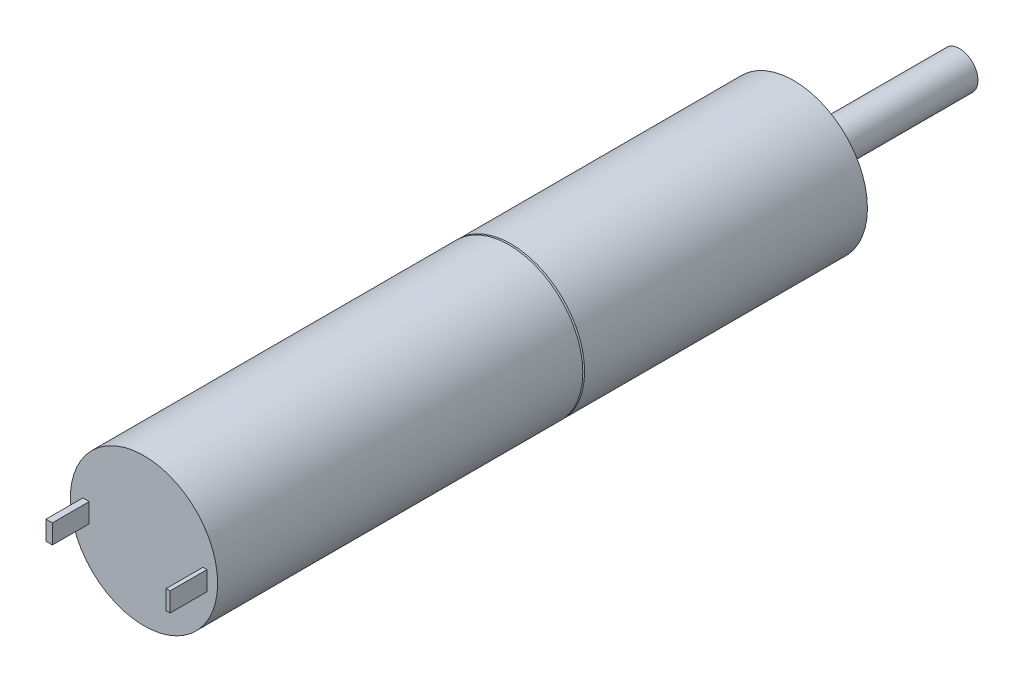
ISO-10303-21;
HEADER;
FILE_DESCRIPTION(('STEP AP214'),'2;1');
FILE_NAME('part.step','',(''),(''),'','','');
FILE_SCHEMA(('AUTOMOTIVE_DESIGN { 1 0 10303 214 1 1 1 1 }'));
ENDSEC;
DATA;
#1=APPLICATION_CONTEXT('core data for automotive mechanical design processes');
#2=APPLICATION_PROTOCOL_DEFINITION('international standard','automotive_design',2000,#1);
#3=PRODUCT_CONTEXT('',#1,'mechanical');
#4=PRODUCT('Part','Part','',(#3));
#5=PRODUCT_RELATED_PRODUCT_CATEGORY('part','',(#4));
#6=PRODUCT_DEFINITION_FORMATION('','',#4);
#7=PRODUCT_DEFINITION_CONTEXT('part definition',#1,'design');
#8=PRODUCT_DEFINITION('design','',#6,#7);
#9=PRODUCT_DEFINITION_SHAPE('','',#8);
#10=(LENGTH_UNIT() NAMED_UNIT(*) SI_UNIT(.MILLI.,.METRE.));
#11=(NAMED_UNIT(*) PLANE_ANGLE_UNIT() SI_UNIT($,.RADIAN.));
#12=(NAMED_UNIT(*) SI_UNIT($,.STERADIAN.) SOLID_ANGLE_UNIT());
#13=UNCERTAINTY_MEASURE_WITH_UNIT(LENGTH_MEASURE(1.E-05),#10,'distance_accuracy_value','');
#14=(GEOMETRIC_REPRESENTATION_CONTEXT(3) GLOBAL_UNCERTAINTY_ASSIGNED_CONTEXT((#13)) GLOBAL_UNIT_ASSIGNED_CONTEXT((#10,
#11,#12)) REPRESENTATION_CONTEXT('',''));
#15=CARTESIAN_POINT('',(0.,0.,0.));
#16=DIRECTION('',(0.,0.,1.));
#17=DIRECTION('',(1.,0.,0.));
#18=AXIS2_PLACEMENT_3D('',#15,#16,#17);
#19=CARTESIAN_POINT('',(0.,0.,-23.1));
#20=DIRECTION('',(0.,0.,1.));
#21=DIRECTION('',(1.,0.,0.));
#22=AXIS2_PLACEMENT_3D('',#19,#20,#21);
#23=CYLINDRICAL_SURFACE('',#22,6.);
#24=CARTESIAN_POINT('',(0.,0.,0.0727940468532392));
#25=DIRECTION('',(0.,0.,1.));
#26=DIRECTION('',(1.,0.,0.));
#27=AXIS2_PLACEMENT_3D('',#24,#25,#26);
#28=CIRCLE('',#27,6.);
#29=CARTESIAN_POINT('',(6.,0.,0.0727940468532392));
#30=VERTEX_POINT('',#29);
#31=EDGE_CURVE('E35',#30,#30,#28,.F.);
#32=ORIENTED_EDGE('',*,*,#31,.F.);
#33=EDGE_LOOP('',(#32));
#34=FACE_BOUND('',#33,.T.);
#35=CARTESIAN_POINT('',(0.,0.,29.8));
#36=DIRECTION('',(0.,0.,1.));
#37=DIRECTION('',(1.,0.,0.));
#38=AXIS2_PLACEMENT_3D('',#35,#36,#37);
#39=CIRCLE('',#38,6.);
#40=CARTESIAN_POINT('',(6.,0.,29.8));
#41=VERTEX_POINT('',#40);
#42=EDGE_CURVE('E155',#41,#41,#39,.T.);
#43=ORIENTED_EDGE('',*,*,#42,.F.);
#44=EDGE_LOOP('',(#43));
#45=FACE_BOUND('',#44,.T.);
#46=ADVANCED_FACE('F31',(#34,#45),#23,.T.);
#47=CARTESIAN_POINT('',(0.,0.,29.8));
#48=DIRECTION('',(0.,0.,1.));
#49=DIRECTION('',(1.,0.,0.));
#50=AXIS2_PLACEMENT_3D('',#47,#48,#49);
#51=PLANE('',#50);
#52=DIRECTION('',(1.,0.,0.));
#53=VECTOR('',#52,1.);
#54=CARTESIAN_POINT('',(4.80867690938958,-1.02837535009037,29.8));
#55=LINE('',#54,#53);
#56=CARTESIAN_POINT('',(4.80867690938958,-1.02837535009037,29.8));
#57=VERTEX_POINT('',#56);
#58=CARTESIAN_POINT('',(5.13075329447688,-1.02837535009037,29.8));
#59=VERTEX_POINT('',#58);
#60=EDGE_CURVE('E127',#57,#59,#55,.T.);
#61=ORIENTED_EDGE('',*,*,#60,.F.);
#62=DIRECTION('',(0.,-1.,0.));
#63=VECTOR('',#62,1.);
#64=CARTESIAN_POINT('',(4.80867690938958,0.535540550361091,29.8));
#65=LINE('',#64,#63);
#66=CARTESIAN_POINT('',(4.80867690938958,0.535540550361091,29.8));
#67=VERTEX_POINT('',#66);
#68=EDGE_CURVE('E124',#67,#57,#65,.T.);
#69=ORIENTED_EDGE('',*,*,#68,.F.);
#70=DIRECTION('',(-1.,0.,0.));
#71=VECTOR('',#70,1.);
#72=CARTESIAN_POINT('',(4.80867690938958,0.535540550361091,29.8));
#73=LINE('',#72,#71);
#74=CARTESIAN_POINT('',(5.13075329447688,0.535540550361091,29.8));
#75=VERTEX_POINT('',#74);
#76=EDGE_CURVE('E136',#75,#67,#73,.T.);
#77=ORIENTED_EDGE('',*,*,#76,.F.);
#78=DIRECTION('',(0.,1.,0.));
#79=VECTOR('',#78,1.);
#80=CARTESIAN_POINT('',(5.13075329447688,0.535540550361091,29.8));
#81=LINE('',#80,#79);
#82=EDGE_CURVE('E144',#59,#75,#81,.T.);
#83=ORIENTED_EDGE('',*,*,#82,.F.);
#84=EDGE_LOOP('',(#61,#69,#77,#83));
#85=FACE_BOUND('',#84,.T.);
#86=ORIENTED_EDGE('',*,*,#42,.T.);
#87=EDGE_LOOP('',(#86));
#88=FACE_BOUND('',#87,.T.);
#89=DIRECTION('',(1.,0.,0.));
#90=VECTOR('',#89,1.);
#91=CARTESIAN_POINT('',(-4.9747765863799,-1.02837535009037,29.8));
#92=LINE('',#91,#90);
#93=CARTESIAN_POINT('',(-4.9747765863799,-1.02837535009037,29.8));
#94=VERTEX_POINT('',#93);
#95=CARTESIAN_POINT('',(-4.45506110528449,-1.02837535009037,29.8));
#96=VERTEX_POINT('',#95);
#97=EDGE_CURVE('E189',#94,#96,#92,.T.);
#98=ORIENTED_EDGE('',*,*,#97,.F.);
#99=DIRECTION('',(0.,-1.,0.));
#100=VECTOR('',#99,1.);
#101=CARTESIAN_POINT('',(-4.9747765863799,0.535540550361091,29.8));
#102=LINE('',#101,#100);
#103=CARTESIAN_POINT('',(-4.9747765863799,0.535540550361091,29.8));
#104=VERTEX_POINT('',#103);
#105=EDGE_CURVE('E122',#104,#94,#102,.T.);
#106=ORIENTED_EDGE('',*,*,#105,.F.);
#107=DIRECTION('',(-1.,0.,0.));
#108=VECTOR('',#107,1.);
#109=CARTESIAN_POINT('',(-4.9747765863799,0.535540550361091,29.8));
#110=LINE('',#109,#108);
#111=CARTESIAN_POINT('',(-4.45506110528449,0.535540550361091,29.8));
#112=VERTEX_POINT('',#111);
#113=EDGE_CURVE('E118',#112,#104,#110,.T.);
#114=ORIENTED_EDGE('',*,*,#113,.F.);
#115=DIRECTION('',(0.,1.,0.));
#116=VECTOR('',#115,1.);
#117=CARTESIAN_POINT('',(-4.45506110528449,0.535540550361091,29.8));
#118=LINE('',#117,#116);
#119=EDGE_CURVE('E191',#96,#112,#118,.T.);
#120=ORIENTED_EDGE('',*,*,#119,.F.);
#121=EDGE_LOOP('',(#98,#106,#114,#120));
#122=FACE_BOUND('',#121,.T.);
#123=ADVANCED_FACE('F196',(#85,#88,#122),#51,.T.);
#124=CARTESIAN_POINT('',(4.80867690938958,0.535540550361091,32.8));
#125=DIRECTION('',(1.,0.,0.));
#126=DIRECTION('',(0.,0.,-1.));
#127=AXIS2_PLACEMENT_3D('',#124,#125,#126);
#128=PLANE('',#127);
#129=ORIENTED_EDGE('',*,*,#68,.T.);
#130=DIRECTION('',(0.,0.,-1.));
#131=VECTOR('',#130,1.);
#132=CARTESIAN_POINT('',(4.80867690938958,-1.02837535009037,32.8));
#133=LINE('',#132,#131);
#134=CARTESIAN_POINT('',(4.80867690938958,-1.02837535009037,32.8));
#135=VERTEX_POINT('',#134);
#136=EDGE_CURVE('E153',#135,#57,#133,.T.);
#137=ORIENTED_EDGE('',*,*,#136,.F.);
#138=DIRECTION('',(0.,-1.,0.));
#139=VECTOR('',#138,1.);
#140=CARTESIAN_POINT('',(4.80867690938958,0.535540550361091,32.8));
#141=LINE('',#140,#139);
#142=CARTESIAN_POINT('',(4.80867690938958,0.535540550361091,32.8));
#143=VERTEX_POINT('',#142);
#144=EDGE_CURVE('E132',#143,#135,#141,.T.);
#145=ORIENTED_EDGE('',*,*,#144,.F.);
#146=DIRECTION('',(0.,0.,-1.));
#147=VECTOR('',#146,1.);
#148=CARTESIAN_POINT('',(4.80867690938958,0.535540550361091,32.8));
#149=LINE('',#148,#147);
#150=EDGE_CURVE('E141',#143,#67,#149,.T.);
#151=ORIENTED_EDGE('',*,*,#150,.T.);
#152=EDGE_LOOP('',(#129,#137,#145,#151));
#153=FACE_BOUND('',#152,.T.);
#154=ADVANCED_FACE('F215',(#153),#128,.F.);
#155=CARTESIAN_POINT('',(4.80867690938958,-1.02837535009037,32.8));
#156=DIRECTION('',(0.,1.,0.));
#157=DIRECTION('',(0.,0.,1.));
#158=AXIS2_PLACEMENT_3D('',#155,#156,#157);
#159=PLANE('',#158);
#160=ORIENTED_EDGE('',*,*,#60,.T.);
#161=DIRECTION('',(0.,0.,-1.));
#162=VECTOR('',#161,1.);
#163=CARTESIAN_POINT('',(5.13075329447688,-1.02837535009037,32.8));
#164=LINE('',#163,#162);
#165=CARTESIAN_POINT('',(5.13075329447688,-1.02837535009037,32.8));
#166=VERTEX_POINT('',#165);
#167=EDGE_CURVE('E150',#166,#59,#164,.T.);
#168=ORIENTED_EDGE('',*,*,#167,.F.);
#169=DIRECTION('',(1.,0.,0.));
#170=VECTOR('',#169,1.);
#171=CARTESIAN_POINT('',(4.80867690938958,-1.02837535009037,32.8));
#172=LINE('',#171,#170);
#173=EDGE_CURVE('E135',#135,#166,#172,.T.);
#174=ORIENTED_EDGE('',*,*,#173,.F.);
#175=ORIENTED_EDGE('',*,*,#136,.T.);
#176=EDGE_LOOP('',(#160,#168,#174,#175));
#177=FACE_BOUND('',#176,.T.);
#178=ADVANCED_FACE('F379',(#177),#159,.F.);
#179=CARTESIAN_POINT('',(5.13075329447688,0.535540550361091,32.8));
#180=DIRECTION('',(-1.,0.,0.));
#181=DIRECTION('',(0.,0.,1.));
#182=AXIS2_PLACEMENT_3D('',#179,#180,#181);
#183=PLANE('',#182);
#184=ORIENTED_EDGE('',*,*,#82,.T.);
#185=DIRECTION('',(0.,0.,-1.));
#186=VECTOR('',#185,1.);
#187=CARTESIAN_POINT('',(5.13075329447688,0.535540550361091,32.8));
#188=LINE('',#187,#186);
#189=CARTESIAN_POINT('',(5.13075329447688,0.535540550361091,32.8));
#190=VERTEX_POINT('',#189);
#191=EDGE_CURVE('E56',#190,#75,#188,.T.);
#192=ORIENTED_EDGE('',*,*,#191,.F.);
#193=DIRECTION('',(0.,1.,0.));
#194=VECTOR('',#193,1.);
#195=CARTESIAN_POINT('',(5.13075329447688,0.535540550361091,32.8));
#196=LINE('',#195,#194);
#197=EDGE_CURVE('E138',#166,#190,#196,.T.);
#198=ORIENTED_EDGE('',*,*,#197,.F.);
#199=ORIENTED_EDGE('',*,*,#167,.T.);
#200=EDGE_LOOP('',(#184,#192,#198,#199));
#201=FACE_BOUND('',#200,.T.);
#202=ADVANCED_FACE('F370',(#201),#183,.F.);
#203=CARTESIAN_POINT('',(4.80867690938958,0.535540550361091,32.8));
#204=DIRECTION('',(0.,-1.,0.));
#205=DIRECTION('',(0.,0.,-1.));
#206=AXIS2_PLACEMENT_3D('',#203,#204,#205);
#207=PLANE('',#206);
#208=ORIENTED_EDGE('',*,*,#76,.T.);
#209=ORIENTED_EDGE('',*,*,#150,.F.);
#210=DIRECTION('',(-1.,0.,0.));
#211=VECTOR('',#210,1.);
#212=CARTESIAN_POINT('',(4.80867690938958,0.535540550361091,32.8));
#213=LINE('',#212,#211);
#214=EDGE_CURVE('E140',#190,#143,#213,.T.);
#215=ORIENTED_EDGE('',*,*,#214,.F.);
#216=ORIENTED_EDGE('',*,*,#191,.T.);
#217=EDGE_LOOP('',(#208,#209,#215,#216));
#218=FACE_BOUND('',#217,.T.);
#219=ADVANCED_FACE('F360',(#218),#207,.F.);
#220=CARTESIAN_POINT('',(4.80867690938958,-1.02837535009037,32.8));
#221=DIRECTION('',(0.,0.,1.));
#222=DIRECTION('',(1.,0.,0.));
#223=AXIS2_PLACEMENT_3D('',#220,#221,#222);
#224=PLANE('',#223);
#225=ORIENTED_EDGE('',*,*,#144,.T.);
#226=ORIENTED_EDGE('',*,*,#173,.T.);
#227=ORIENTED_EDGE('',*,*,#197,.T.);
#228=ORIENTED_EDGE('',*,*,#214,.T.);
#229=EDGE_LOOP('',(#225,#226,#227,#228));
#230=FACE_BOUND('',#229,.T.);
#231=ADVANCED_FACE('F351',(#230),#224,.T.);
#232=CARTESIAN_POINT('',(-4.9747765863799,0.535540550361091,32.8));
#233=DIRECTION('',(1.,0.,0.));
#234=DIRECTION('',(0.,0.,-1.));
#235=AXIS2_PLACEMENT_3D('',#232,#233,#234);
#236=PLANE('',#235);
#237=ORIENTED_EDGE('',*,*,#105,.T.);
#238=DIRECTION('',(0.,0.,-1.));
#239=VECTOR('',#238,1.);
#240=CARTESIAN_POINT('',(-4.9747765863799,-1.02837535009037,32.8));
#241=LINE('',#240,#239);
#242=CARTESIAN_POINT('',(-4.9747765863799,-1.02837535009037,32.8));
#243=VERTEX_POINT('',#242);
#244=EDGE_CURVE('E103',#243,#94,#241,.T.);
#245=ORIENTED_EDGE('',*,*,#244,.F.);
#246=DIRECTION('',(0.,-1.,0.));
#247=VECTOR('',#246,1.);
#248=CARTESIAN_POINT('',(-4.9747765863799,0.535540550361091,32.8));
#249=LINE('',#248,#247);
#250=CARTESIAN_POINT('',(-4.9747765863799,0.535540550361091,32.8));
#251=VERTEX_POINT('',#250);
#252=EDGE_CURVE('E110',#251,#243,#249,.T.);
#253=ORIENTED_EDGE('',*,*,#252,.F.);
#254=DIRECTION('',(0.,0.,-1.));
#255=VECTOR('',#254,1.);
#256=CARTESIAN_POINT('',(-4.9747765863799,0.535540550361091,32.8));
#257=LINE('',#256,#255);
#258=EDGE_CURVE('E187',#251,#104,#257,.T.);
#259=ORIENTED_EDGE('',*,*,#258,.T.);
#260=EDGE_LOOP('',(#237,#245,#253,#259));
#261=FACE_BOUND('',#260,.T.);
#262=ADVANCED_FACE('F120',(#261),#236,.F.);
#263=CARTESIAN_POINT('',(-4.9747765863799,-1.02837535009037,32.8));
#264=DIRECTION('',(0.,1.,0.));
#265=DIRECTION('',(0.,0.,1.));
#266=AXIS2_PLACEMENT_3D('',#263,#264,#265);
#267=PLANE('',#266);
#268=ORIENTED_EDGE('',*,*,#97,.T.);
#269=DIRECTION('',(0.,0.,-1.));
#270=VECTOR('',#269,1.);
#271=CARTESIAN_POINT('',(-4.45506110528449,-1.02837535009037,32.8));
#272=LINE('',#271,#270);
#273=CARTESIAN_POINT('',(-4.45506110528449,-1.02837535009037,32.8));
#274=VERTEX_POINT('',#273);
#275=EDGE_CURVE('E106',#274,#96,#272,.T.);
#276=ORIENTED_EDGE('',*,*,#275,.F.);
#277=DIRECTION('',(1.,0.,0.));
#278=VECTOR('',#277,1.);
#279=CARTESIAN_POINT('',(-4.9747765863799,-1.02837535009037,32.8));
#280=LINE('',#279,#278);
#281=EDGE_CURVE('E99',#243,#274,#280,.T.);
#282=ORIENTED_EDGE('',*,*,#281,.F.);
#283=ORIENTED_EDGE('',*,*,#244,.T.);
#284=EDGE_LOOP('',(#268,#276,#282,#283));
#285=FACE_BOUND('',#284,.T.);
#286=ADVANCED_FACE('F101',(#285),#267,.F.);
#287=CARTESIAN_POINT('',(-4.45506110528449,0.535540550361091,32.8));
#288=DIRECTION('',(-1.,0.,0.));
#289=DIRECTION('',(0.,0.,1.));
#290=AXIS2_PLACEMENT_3D('',#287,#288,#289);
#291=PLANE('',#290);
#292=ORIENTED_EDGE('',*,*,#119,.T.);
#293=DIRECTION('',(0.,0.,-1.));
#294=VECTOR('',#293,1.);
#295=CARTESIAN_POINT('',(-4.45506110528449,0.535540550361091,32.8));
#296=LINE('',#295,#294);
#297=CARTESIAN_POINT('',(-4.45506110528449,0.535540550361091,32.8));
#298=VERTEX_POINT('',#297);
#299=EDGE_CURVE('E48',#298,#112,#296,.T.);
#300=ORIENTED_EDGE('',*,*,#299,.F.);
#301=DIRECTION('',(0.,1.,0.));
#302=VECTOR('',#301,1.);
#303=CARTESIAN_POINT('',(-4.45506110528449,0.535540550361091,32.8));
#304=LINE('',#303,#302);
#305=EDGE_CURVE('E109',#274,#298,#304,.T.);
#306=ORIENTED_EDGE('',*,*,#305,.F.);
#307=ORIENTED_EDGE('',*,*,#275,.T.);
#308=EDGE_LOOP('',(#292,#300,#306,#307));
#309=FACE_BOUND('',#308,.T.);
#310=ADVANCED_FACE('F199',(#309),#291,.F.);
#311=CARTESIAN_POINT('',(-4.9747765863799,0.535540550361091,32.8));
#312=DIRECTION('',(0.,-1.,0.));
#313=DIRECTION('',(0.,0.,-1.));
#314=AXIS2_PLACEMENT_3D('',#311,#312,#313);
#315=PLANE('',#314);
#316=ORIENTED_EDGE('',*,*,#113,.T.);
#317=ORIENTED_EDGE('',*,*,#258,.F.);
#318=DIRECTION('',(-1.,0.,0.));
#319=VECTOR('',#318,1.);
#320=CARTESIAN_POINT('',(-4.9747765863799,0.535540550361091,32.8));
#321=LINE('',#320,#319);
#322=EDGE_CURVE('E114',#298,#251,#321,.T.);
#323=ORIENTED_EDGE('',*,*,#322,.F.);
#324=ORIENTED_EDGE('',*,*,#299,.T.);
#325=EDGE_LOOP('',(#316,#317,#323,#324));
#326=FACE_BOUND('',#325,.T.);
#327=ADVANCED_FACE('F200',(#326),#315,.F.);
#328=CARTESIAN_POINT('',(-4.9747765863799,-1.02837535009037,32.8));
#329=DIRECTION('',(0.,0.,1.));
#330=DIRECTION('',(1.,0.,0.));
#331=AXIS2_PLACEMENT_3D('',#328,#329,#330);
#332=PLANE('',#331);
#333=ORIENTED_EDGE('',*,*,#252,.T.);
#334=ORIENTED_EDGE('',*,*,#281,.T.);
#335=ORIENTED_EDGE('',*,*,#305,.T.);
#336=ORIENTED_EDGE('',*,*,#322,.T.);
#337=EDGE_LOOP('',(#333,#334,#335,#336));
#338=FACE_BOUND('',#337,.T.);
#339=ADVANCED_FACE('F113',(#338),#332,.T.);
#340=CARTESIAN_POINT('',(0.,0.,0.714830227866669));
#341=DIRECTION('',(0.,0.,1.));
#342=DIRECTION('',(1.,0.,0.));
#343=AXIS2_PLACEMENT_3D('',#340,#341,#342);
#344=CONICAL_SURFACE('',#343,7.76397990980731,1.22173047639604);
#345=ORIENTED_EDGE('',*,*,#31,.T.);
#346=EDGE_LOOP('',(#345));
#347=FACE_BOUND('',#346,.T.);
#348=CARTESIAN_POINT('',(0.,0.,0.));
#349=DIRECTION('',(0.,0.,-1.));
#350=DIRECTION('',(-1.,0.,0.));
#351=AXIS2_PLACEMENT_3D('',#348,#349,#350);
#352=CIRCLE('',#351,5.8);
#353=CARTESIAN_POINT('',(-5.8,0.,0.));
#354=VERTEX_POINT('',#353);
#355=EDGE_CURVE('E161',#354,#354,#352,.T.);
#356=ORIENTED_EDGE('',*,*,#355,.F.);
#357=EDGE_LOOP('',(#356));
#358=FACE_BOUND('',#357,.T.);
#359=ADVANCED_FACE('F207',(#347,#358),#344,.T.);
#360=CARTESIAN_POINT('',(0.,0.,0.));
#361=DIRECTION('',(0.,0.,-1.));
#362=DIRECTION('',(-1.,0.,0.));
#363=AXIS2_PLACEMENT_3D('',#360,#361,#362);
#364=CONICAL_SURFACE('',#363,5.8,1.22173047639603);
#365=CARTESIAN_POINT('',(0.,0.,-0.0727940468532405));
#366=DIRECTION('',(0.,0.,-1.));
#367=DIRECTION('',(-1.,0.,0.));
#368=AXIS2_PLACEMENT_3D('',#365,#366,#367);
#369=CIRCLE('',#368,6.);
#370=CARTESIAN_POINT('',(-6.,0.,-0.0727940468532405));
#371=VERTEX_POINT('',#370);
#372=EDGE_CURVE('E159',#371,#371,#369,.F.);
#373=ORIENTED_EDGE('',*,*,#372,.T.);
#374=EDGE_LOOP('',(#373));
#375=FACE_BOUND('',#374,.T.);
#376=ORIENTED_EDGE('',*,*,#355,.T.);
#377=EDGE_LOOP('',(#376));
#378=FACE_BOUND('',#377,.T.);
#379=ADVANCED_FACE('F253',(#375,#378),#364,.T.);
#380=CARTESIAN_POINT('',(0.,0.,-36.6));
#381=DIRECTION('',(0.,0.,-1.));
#382=DIRECTION('',(-1.,0.,0.));
#383=AXIS2_PLACEMENT_3D('',#380,#381,#382);
#384=PLANE('',#383);
#385=CARTESIAN_POINT('',(0.,0.,-36.6));
#386=DIRECTION('',(0.,0.,-1.));
#387=DIRECTION('',(-1.,0.,0.));
#388=AXIS2_PLACEMENT_3D('',#385,#386,#387);
#389=CIRCLE('',#388,1.5);
#390=CARTESIAN_POINT('',(-1.5,0.,-36.6));
#391=VERTEX_POINT('',#390);
#392=EDGE_CURVE('E180',#391,#391,#389,.T.);
#393=ORIENTED_EDGE('',*,*,#392,.T.);
#394=EDGE_LOOP('',(#393));
#395=FACE_BOUND('',#394,.T.);
#396=ADVANCED_FACE('F251',(#395),#384,.T.);
#397=CARTESIAN_POINT('',(-4.75,0.,-9.6));
#398=DIRECTION('',(0.,0.,-1.));
#399=DIRECTION('',(-1.,0.,0.));
#400=AXIS2_PLACEMENT_3D('',#397,#398,#399);
#401=PLANE('',#400);
#402=CARTESIAN_POINT('',(-4.75,0.,-9.6));
#403=DIRECTION('',(0.,0.,-1.));
#404=DIRECTION('',(-1.,0.,0.));
#405=AXIS2_PLACEMENT_3D('',#402,#403,#404);
#406=CIRCLE('',#405,1.);
#407=CARTESIAN_POINT('',(-5.75,0.,-9.6));
#408=VERTEX_POINT('',#407);
#409=EDGE_CURVE('E177',#408,#408,#406,.T.);
#410=ORIENTED_EDGE('',*,*,#409,.T.);
#411=EDGE_LOOP('',(#410));
#412=FACE_BOUND('',#411,.T.);
#413=ADVANCED_FACE('F246',(#412),#401,.T.);
#414=CARTESIAN_POINT('',(4.75,0.,-9.6));
#415=DIRECTION('',(0.,0.,-1.));
#416=DIRECTION('',(-1.,0.,0.));
#417=AXIS2_PLACEMENT_3D('',#414,#415,#416);
#418=PLANE('',#417);
#419=CARTESIAN_POINT('',(4.75,0.,-9.6));
#420=DIRECTION('',(0.,0.,-1.));
#421=DIRECTION('',(-1.,0.,0.));
#422=AXIS2_PLACEMENT_3D('',#419,#420,#421);
#423=CIRCLE('',#422,1.);
#424=CARTESIAN_POINT('',(3.75,0.,-9.6));
#425=VERTEX_POINT('',#424);
#426=EDGE_CURVE('E171',#425,#425,#423,.T.);
#427=ORIENTED_EDGE('',*,*,#426,.T.);
#428=EDGE_LOOP('',(#427));
#429=FACE_BOUND('',#428,.T.);
#430=ADVANCED_FACE('F237',(#429),#418,.T.);
#431=CARTESIAN_POINT('',(0.,0.,-36.6));
#432=DIRECTION('',(0.,0.,1.));
#433=DIRECTION('',(1.,0.,0.));
#434=AXIS2_PLACEMENT_3D('',#431,#432,#433);
#435=CYLINDRICAL_SURFACE('',#434,1.5);
#436=ORIENTED_EDGE('',*,*,#392,.F.);
#437=EDGE_LOOP('',(#436));
#438=FACE_BOUND('',#437,.T.);
#439=CARTESIAN_POINT('',(0.,0.,-23.1));
#440=DIRECTION('',(0.,0.,1.));
#441=DIRECTION('',(1.,0.,0.));
#442=AXIS2_PLACEMENT_3D('',#439,#440,#441);
#443=CIRCLE('',#442,1.5);
#444=CARTESIAN_POINT('',(1.5,0.,-23.1));
#445=VERTEX_POINT('',#444);
#446=EDGE_CURVE('E11',#445,#445,#443,.F.);
#447=ORIENTED_EDGE('',*,*,#446,.T.);
#448=EDGE_LOOP('',(#447));
#449=FACE_BOUND('',#448,.T.);
#450=ADVANCED_FACE('F234',(#438,#449),#435,.T.);
#451=CARTESIAN_POINT('',(-4.75,0.,-9.6));
#452=DIRECTION('',(0.,0.,-1.));
#453=DIRECTION('',(-1.,0.,0.));
#454=AXIS2_PLACEMENT_3D('',#451,#452,#453);
#455=CYLINDRICAL_SURFACE('',#454,1.);
#456=ORIENTED_EDGE('',*,*,#409,.F.);
#457=EDGE_LOOP('',(#456));
#458=FACE_BOUND('',#457,.T.);
#459=CARTESIAN_POINT('',(-4.75,0.,-23.1));
#460=DIRECTION('',(0.,0.,-1.));
#461=DIRECTION('',(-1.,0.,0.));
#462=AXIS2_PLACEMENT_3D('',#459,#460,#461);
#463=CIRCLE('',#462,1.);
#464=CARTESIAN_POINT('',(-5.75,0.,-23.1));
#465=VERTEX_POINT('',#464);
#466=EDGE_CURVE('E174',#465,#465,#463,.T.);
#467=ORIENTED_EDGE('',*,*,#466,.T.);
#468=EDGE_LOOP('',(#467));
#469=FACE_BOUND('',#468,.T.);
#470=ADVANCED_FACE('F236',(#458,#469),#455,.F.);
#471=CARTESIAN_POINT('',(4.75,0.,-9.6));
#472=DIRECTION('',(0.,0.,-1.));
#473=DIRECTION('',(-1.,0.,0.));
#474=AXIS2_PLACEMENT_3D('',#471,#472,#473);
#475=CYLINDRICAL_SURFACE('',#474,1.);
#476=ORIENTED_EDGE('',*,*,#426,.F.);
#477=EDGE_LOOP('',(#476));
#478=FACE_BOUND('',#477,.T.);
#479=CARTESIAN_POINT('',(4.75,0.,-23.1));
#480=DIRECTION('',(0.,0.,-1.));
#481=DIRECTION('',(-1.,0.,0.));
#482=AXIS2_PLACEMENT_3D('',#479,#480,#481);
#483=CIRCLE('',#482,1.);
#484=CARTESIAN_POINT('',(3.75,0.,-23.1));
#485=VERTEX_POINT('',#484);
#486=EDGE_CURVE('E165',#485,#485,#483,.T.);
#487=ORIENTED_EDGE('',*,*,#486,.T.);
#488=EDGE_LOOP('',(#487));
#489=FACE_BOUND('',#488,.T.);
#490=ADVANCED_FACE('F226',(#478,#489),#475,.F.);
#491=CARTESIAN_POINT('',(0.,0.,-23.1));
#492=DIRECTION('',(0.,0.,1.));
#493=DIRECTION('',(1.,0.,0.));
#494=AXIS2_PLACEMENT_3D('',#491,#492,#493);
#495=PLANE('',#494);
#496=ORIENTED_EDGE('',*,*,#486,.F.);
#497=EDGE_LOOP('',(#496));
#498=FACE_BOUND('',#497,.T.);
#499=ORIENTED_EDGE('',*,*,#466,.F.);
#500=EDGE_LOOP('',(#499));
#501=FACE_BOUND('',#500,.T.);
#502=CARTESIAN_POINT('',(0.,0.,-23.1));
#503=DIRECTION('',(0.,0.,1.));
#504=DIRECTION('',(1.,0.,0.));
#505=AXIS2_PLACEMENT_3D('',#502,#503,#504);
#506=CIRCLE('',#505,6.);
#507=CARTESIAN_POINT('',(6.,0.,-23.1));
#508=VERTEX_POINT('',#507);
#509=EDGE_CURVE('E40',#508,#508,#506,.T.);
#510=ORIENTED_EDGE('',*,*,#509,.F.);
#511=EDGE_LOOP('',(#510));
#512=FACE_BOUND('',#511,.T.);
#513=ORIENTED_EDGE('',*,*,#446,.F.);
#514=EDGE_LOOP('',(#513));
#515=FACE_BOUND('',#514,.T.);
#516=ADVANCED_FACE('F221',(#498,#501,#512,#515),#495,.F.);
#517=ORIENTED_EDGE('',*,*,#372,.F.);
#518=EDGE_LOOP('',(#517));
#519=FACE_BOUND('',#518,.T.);
#520=ORIENTED_EDGE('',*,*,#509,.T.);
#521=EDGE_LOOP('',(#520));
#522=FACE_BOUND('',#521,.T.);
#523=ADVANCED_FACE('F33',(#519,#522),#23,.T.);
#524=CLOSED_SHELL('',(#46,#123,#154,#178,#202,#219,#231,#262,#286,#310,#327,#339,#359,#379,#396,
#413,#430,#450,#470,#490,#516,#523));
#525=MANIFOLD_SOLID_BREP('B2',#524);
#526=ADVANCED_BREP_SHAPE_REPRESENTATION('',(#18,#525),#14);
#527=SHAPE_DEFINITION_REPRESENTATION(#9,#526);
ENDSEC;
END-ISO-10303-21;
